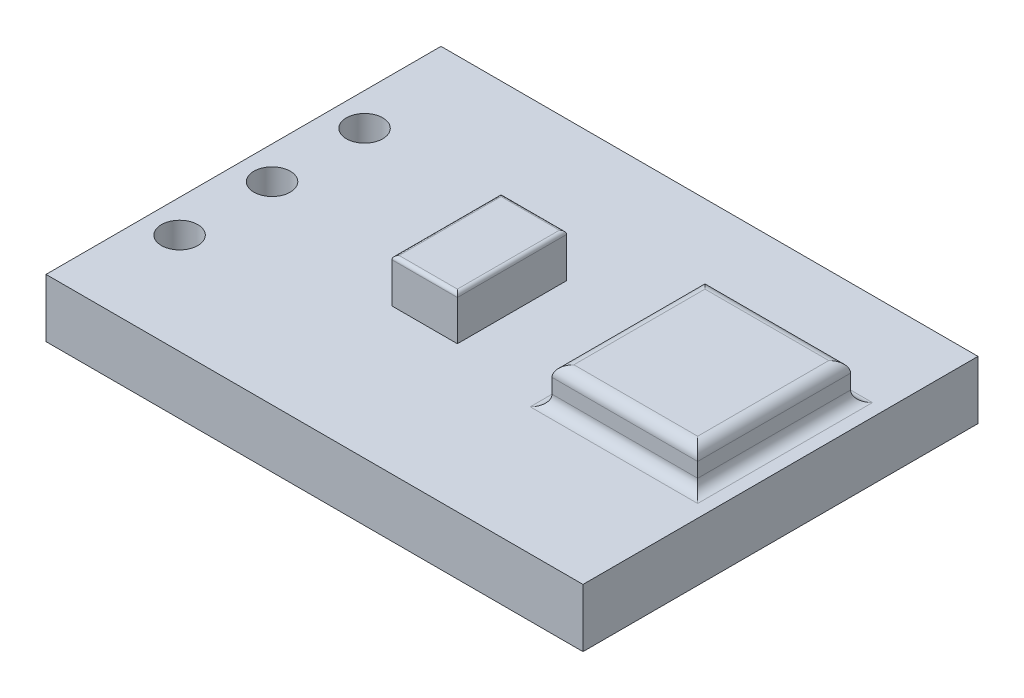
ISO-10303-21;
HEADER;
FILE_DESCRIPTION(('STEP AP214'),'2;1');
FILE_NAME('part.step','',(''),(''),'','','');
FILE_SCHEMA(('AUTOMOTIVE_DESIGN { 1 0 10303 214 1 1 1 1 }'));
ENDSEC;
DATA;
#1=APPLICATION_CONTEXT('core data for automotive mechanical design processes');
#2=APPLICATION_PROTOCOL_DEFINITION('international standard','automotive_design',2000,#1);
#3=PRODUCT_CONTEXT('',#1,'mechanical');
#4=PRODUCT('Part','Part','',(#3));
#5=PRODUCT_RELATED_PRODUCT_CATEGORY('part','',(#4));
#6=PRODUCT_DEFINITION_FORMATION('','',#4);
#7=PRODUCT_DEFINITION_CONTEXT('part definition',#1,'design');
#8=PRODUCT_DEFINITION('design','',#6,#7);
#9=PRODUCT_DEFINITION_SHAPE('','',#8);
#10=(LENGTH_UNIT() NAMED_UNIT(*) SI_UNIT(.MILLI.,.METRE.));
#11=(NAMED_UNIT(*) PLANE_ANGLE_UNIT() SI_UNIT($,.RADIAN.));
#12=(NAMED_UNIT(*) SI_UNIT($,.STERADIAN.) SOLID_ANGLE_UNIT());
#13=UNCERTAINTY_MEASURE_WITH_UNIT(LENGTH_MEASURE(1.E-05),#10,'distance_accuracy_value','');
#14=(GEOMETRIC_REPRESENTATION_CONTEXT(3) GLOBAL_UNCERTAINTY_ASSIGNED_CONTEXT((#13)) GLOBAL_UNIT_ASSIGNED_CONTEXT((#10,
#11,#12)) REPRESENTATION_CONTEXT('',''));
#15=CARTESIAN_POINT('',(0.,0.,0.));
#16=DIRECTION('',(0.,0.,1.));
#17=DIRECTION('',(1.,0.,0.));
#18=AXIS2_PLACEMENT_3D('',#15,#16,#17);
#19=CARTESIAN_POINT('',(0.,1.6,0.));
#20=DIRECTION('',(0.,-1.,0.));
#21=DIRECTION('',(0.,0.,-1.));
#22=AXIS2_PLACEMENT_3D('',#19,#20,#21);
#23=PLANE('',#22);
#24=DIRECTION('',(0.,0.,1.));
#25=VECTOR('',#24,1.);
#26=CARTESIAN_POINT('',(-344.632928539999,1.6,4.01829220130623));
#27=LINE('',#26,#25);
#28=CARTESIAN_POINT('',(-344.632928539999,1.6,8.51829220130623));
#29=VERTEX_POINT('',#28);
#30=CARTESIAN_POINT('',(-344.632928539999,1.6,3.71829220130623));
#31=VERTEX_POINT('',#30);
#32=EDGE_CURVE('E254',#29,#31,#27,.F.);
#33=ORIENTED_EDGE('',*,*,#32,.T.);
#34=DIRECTION('',(1.,0.,0.));
#35=VECTOR('',#34,1.);
#36=CARTESIAN_POINT('',(0.,1.6,3.71829220130623));
#37=LINE('',#36,#35);
#38=CARTESIAN_POINT('',(-340.032928539999,1.6,3.71829220130623));
#39=VERTEX_POINT('',#38);
#40=EDGE_CURVE('E256',#31,#39,#37,.T.);
#41=ORIENTED_EDGE('',*,*,#40,.T.);
#42=DIRECTION('',(0.,0.,1.));
#43=VECTOR('',#42,1.);
#44=CARTESIAN_POINT('',(-340.032928539999,1.6,0.));
#45=LINE('',#44,#43);
#46=CARTESIAN_POINT('',(-340.032928539999,1.6,8.51829220130623));
#47=VERTEX_POINT('',#46);
#48=EDGE_CURVE('E250',#39,#47,#45,.T.);
#49=ORIENTED_EDGE('',*,*,#48,.T.);
#50=DIRECTION('',(1.,0.,0.));
#51=VECTOR('',#50,1.);
#52=CARTESIAN_POINT('',(-344.332928539999,1.6,8.51829220130623));
#53=LINE('',#52,#51);
#54=EDGE_CURVE('E252',#47,#29,#53,.F.);
#55=ORIENTED_EDGE('',*,*,#54,.T.);
#56=EDGE_LOOP('',(#33,#41,#49,#55));
#57=FACE_BOUND('',#56,.T.);
#58=DIRECTION('',(0.,0.,1.));
#59=VECTOR('',#58,1.);
#60=CARTESIAN_POINT('',(-354.432928539998,1.6,12.0182922013062));
#61=LINE('',#60,#59);
#62=CARTESIAN_POINT('',(-354.432928539998,1.6,1.16829220130623));
#63=VERTEX_POINT('',#62);
#64=CARTESIAN_POINT('',(-354.432928539998,1.6,12.0182922013062));
#65=VERTEX_POINT('',#64);
#66=EDGE_CURVE('E221',#63,#65,#61,.T.);
#67=ORIENTED_EDGE('',*,*,#66,.T.);
#68=DIRECTION('',(1.,0.,0.));
#69=VECTOR('',#68,1.);
#70=CARTESIAN_POINT('',(-354.432928539998,1.6,12.0182922013062));
#71=LINE('',#70,#69);
#72=CARTESIAN_POINT('',(-339.682928539999,1.6,12.0182922013062));
#73=VERTEX_POINT('',#72);
#74=EDGE_CURVE('E224',#65,#73,#71,.T.);
#75=ORIENTED_EDGE('',*,*,#74,.T.);
#76=DIRECTION('',(0.,0.,-1.));
#77=VECTOR('',#76,1.);
#78=CARTESIAN_POINT('',(-339.682928539999,1.6,12.0182922013062));
#79=LINE('',#78,#77);
#80=CARTESIAN_POINT('',(-339.682928539999,1.6,1.16829220130623));
#81=VERTEX_POINT('',#80);
#82=EDGE_CURVE('E227',#73,#81,#79,.T.);
#83=ORIENTED_EDGE('',*,*,#82,.T.);
#84=DIRECTION('',(-1.,0.,0.));
#85=VECTOR('',#84,1.);
#86=CARTESIAN_POINT('',(-354.432928539998,1.6,1.16829220130623));
#87=LINE('',#86,#85);
#88=EDGE_CURVE('E229',#81,#63,#87,.T.);
#89=ORIENTED_EDGE('',*,*,#88,.T.);
#90=EDGE_LOOP('',(#67,#75,#83,#89));
#91=FACE_BOUND('',#90,.T.);
#92=CARTESIAN_POINT('',(-353.532928539999,1.6,4.16829220130623));
#93=DIRECTION('',(0.,1.,0.));
#94=DIRECTION('',(0.,0.,1.));
#95=AXIS2_PLACEMENT_3D('',#92,#93,#94);
#96=CIRCLE('',#95,0.500000000000026);
#97=CARTESIAN_POINT('',(-353.532928539999,1.6,4.66829220130626));
#98=VERTEX_POINT('',#97);
#99=EDGE_CURVE('E214',#98,#98,#96,.T.);
#100=ORIENTED_EDGE('',*,*,#99,.F.);
#101=EDGE_LOOP('',(#100));
#102=FACE_BOUND('',#101,.T.);
#103=CARTESIAN_POINT('',(-353.532928539998,1.6,9.24829220130623));
#104=DIRECTION('',(0.,1.,0.));
#105=DIRECTION('',(0.,0.,1.));
#106=AXIS2_PLACEMENT_3D('',#103,#104,#105);
#107=CIRCLE('',#106,0.500000000000026);
#108=CARTESIAN_POINT('',(-353.532928539998,1.6,9.74829220130626));
#109=VERTEX_POINT('',#108);
#110=EDGE_CURVE('E211',#109,#109,#107,.T.);
#111=ORIENTED_EDGE('',*,*,#110,.F.);
#112=EDGE_LOOP('',(#111));
#113=FACE_BOUND('',#112,.T.);
#114=CARTESIAN_POINT('',(-353.532928539999,1.6,6.70829220130623));
#115=DIRECTION('',(0.,1.,0.));
#116=DIRECTION('',(0.,0.,1.));
#117=AXIS2_PLACEMENT_3D('',#114,#115,#116);
#118=CIRCLE('',#117,0.500000000000026);
#119=CARTESIAN_POINT('',(-353.532928539999,1.6,7.20829220130626));
#120=VERTEX_POINT('',#119);
#121=EDGE_CURVE('E205',#120,#120,#118,.T.);
#122=ORIENTED_EDGE('',*,*,#121,.F.);
#123=EDGE_LOOP('',(#122));
#124=FACE_BOUND('',#123,.T.);
#125=DIRECTION('',(0.,0.,1.));
#126=VECTOR('',#125,1.);
#127=CARTESIAN_POINT('',(-348.932928539998,1.6,8.01829220130623));
#128=LINE('',#127,#126);
#129=CARTESIAN_POINT('',(-348.932928539998,1.6,5.01829220130623));
#130=VERTEX_POINT('',#129);
#131=CARTESIAN_POINT('',(-348.932928539998,1.6,8.01829220130623));
#132=VERTEX_POINT('',#131);
#133=EDGE_CURVE('E161',#130,#132,#128,.T.);
#134=ORIENTED_EDGE('',*,*,#133,.F.);
#135=DIRECTION('',(-1.,0.,0.));
#136=VECTOR('',#135,1.);
#137=CARTESIAN_POINT('',(-348.932928539998,1.6,5.01829220130623));
#138=LINE('',#137,#136);
#139=CARTESIAN_POINT('',(-347.132928539998,1.6,5.01829220130623));
#140=VERTEX_POINT('',#139);
#141=EDGE_CURVE('E168',#140,#130,#138,.T.);
#142=ORIENTED_EDGE('',*,*,#141,.F.);
#143=DIRECTION('',(0.,0.,-1.));
#144=VECTOR('',#143,1.);
#145=CARTESIAN_POINT('',(-347.132928539998,1.6,8.01829220130623));
#146=LINE('',#145,#144);
#147=CARTESIAN_POINT('',(-347.132928539998,1.6,8.01829220130623));
#148=VERTEX_POINT('',#147);
#149=EDGE_CURVE('E180',#148,#140,#146,.T.);
#150=ORIENTED_EDGE('',*,*,#149,.F.);
#151=DIRECTION('',(1.,0.,0.));
#152=VECTOR('',#151,1.);
#153=CARTESIAN_POINT('',(-348.932928539998,1.6,8.01829220130623));
#154=LINE('',#153,#152);
#155=EDGE_CURVE('E176',#132,#148,#154,.T.);
#156=ORIENTED_EDGE('',*,*,#155,.F.);
#157=EDGE_LOOP('',(#134,#142,#150,#156));
#158=FACE_BOUND('',#157,.T.);
#159=ADVANCED_FACE('F32',(#57,#91,#102,#113,#124,#158),#23,.F.);
#160=CARTESIAN_POINT('',(-354.432928539998,1.6,12.0182922013062));
#161=DIRECTION('',(1.,0.,0.));
#162=DIRECTION('',(0.,0.,-1.));
#163=AXIS2_PLACEMENT_3D('',#160,#161,#162);
#164=PLANE('',#163);
#165=DIRECTION('',(0.,0.,1.));
#166=VECTOR('',#165,1.);
#167=CARTESIAN_POINT('',(-354.432928539998,0.,12.0182922013062));
#168=LINE('',#167,#166);
#169=CARTESIAN_POINT('',(-354.432928539998,0.,1.16829220130623));
#170=VERTEX_POINT('',#169);
#171=CARTESIAN_POINT('',(-354.432928539998,0.,12.0182922013062));
#172=VERTEX_POINT('',#171);
#173=EDGE_CURVE('E220',#170,#172,#168,.T.);
#174=ORIENTED_EDGE('',*,*,#173,.T.);
#175=DIRECTION('',(0.,-1.,0.));
#176=VECTOR('',#175,1.);
#177=CARTESIAN_POINT('',(-354.432928539998,1.6,12.0182922013062));
#178=LINE('',#177,#176);
#179=EDGE_CURVE('E247',#65,#172,#178,.T.);
#180=ORIENTED_EDGE('',*,*,#179,.F.);
#181=ORIENTED_EDGE('',*,*,#66,.F.);
#182=DIRECTION('',(0.,-1.,0.));
#183=VECTOR('',#182,1.);
#184=CARTESIAN_POINT('',(-354.432928539998,1.6,1.16829220130623));
#185=LINE('',#184,#183);
#186=EDGE_CURVE('E231',#63,#170,#185,.T.);
#187=ORIENTED_EDGE('',*,*,#186,.T.);
#188=EDGE_LOOP('',(#174,#180,#181,#187));
#189=FACE_BOUND('',#188,.T.);
#190=ADVANCED_FACE('F351',(#189),#164,.F.);
#191=CARTESIAN_POINT('',(-354.432928539998,1.6,12.0182922013062));
#192=DIRECTION('',(0.,0.,-1.));
#193=DIRECTION('',(-1.,0.,0.));
#194=AXIS2_PLACEMENT_3D('',#191,#192,#193);
#195=PLANE('',#194);
#196=DIRECTION('',(1.,0.,0.));
#197=VECTOR('',#196,1.);
#198=CARTESIAN_POINT('',(-354.432928539998,0.,12.0182922013062));
#199=LINE('',#198,#197);
#200=CARTESIAN_POINT('',(-339.682928539999,0.,12.0182922013062));
#201=VERTEX_POINT('',#200);
#202=EDGE_CURVE('E234',#172,#201,#199,.T.);
#203=ORIENTED_EDGE('',*,*,#202,.T.);
#204=DIRECTION('',(0.,-1.,0.));
#205=VECTOR('',#204,1.);
#206=CARTESIAN_POINT('',(-339.682928539999,1.6,12.0182922013062));
#207=LINE('',#206,#205);
#208=EDGE_CURVE('E244',#73,#201,#207,.T.);
#209=ORIENTED_EDGE('',*,*,#208,.F.);
#210=ORIENTED_EDGE('',*,*,#74,.F.);
#211=ORIENTED_EDGE('',*,*,#179,.T.);
#212=EDGE_LOOP('',(#203,#209,#210,#211));
#213=FACE_BOUND('',#212,.T.);
#214=ADVANCED_FACE('F357',(#213),#195,.F.);
#215=CARTESIAN_POINT('',(-339.682928539999,1.6,12.0182922013062));
#216=DIRECTION('',(-1.,0.,0.));
#217=DIRECTION('',(0.,0.,1.));
#218=AXIS2_PLACEMENT_3D('',#215,#216,#217);
#219=PLANE('',#218);
#220=DIRECTION('',(0.,0.,-1.));
#221=VECTOR('',#220,1.);
#222=CARTESIAN_POINT('',(-339.682928539999,0.,12.0182922013062));
#223=LINE('',#222,#221);
#224=CARTESIAN_POINT('',(-339.682928539999,0.,1.16829220130623));
#225=VERTEX_POINT('',#224);
#226=EDGE_CURVE('E236',#201,#225,#223,.T.);
#227=ORIENTED_EDGE('',*,*,#226,.T.);
#228=DIRECTION('',(0.,-1.,0.));
#229=VECTOR('',#228,1.);
#230=CARTESIAN_POINT('',(-339.682928539999,1.6,1.16829220130623));
#231=LINE('',#230,#229);
#232=EDGE_CURVE('E241',#81,#225,#231,.T.);
#233=ORIENTED_EDGE('',*,*,#232,.F.);
#234=ORIENTED_EDGE('',*,*,#82,.F.);
#235=ORIENTED_EDGE('',*,*,#208,.T.);
#236=EDGE_LOOP('',(#227,#233,#234,#235));
#237=FACE_BOUND('',#236,.T.);
#238=ADVANCED_FACE('F372',(#237),#219,.F.);
#239=CARTESIAN_POINT('',(-354.432928539998,1.6,1.16829220130623));
#240=DIRECTION('',(0.,0.,1.));
#241=DIRECTION('',(1.,0.,0.));
#242=AXIS2_PLACEMENT_3D('',#239,#240,#241);
#243=PLANE('',#242);
#244=DIRECTION('',(-1.,0.,0.));
#245=VECTOR('',#244,1.);
#246=CARTESIAN_POINT('',(-354.432928539998,0.,1.16829220130623));
#247=LINE('',#246,#245);
#248=EDGE_CURVE('E225',#225,#170,#247,.T.);
#249=ORIENTED_EDGE('',*,*,#248,.T.);
#250=ORIENTED_EDGE('',*,*,#186,.F.);
#251=ORIENTED_EDGE('',*,*,#88,.F.);
#252=ORIENTED_EDGE('',*,*,#232,.T.);
#253=EDGE_LOOP('',(#249,#250,#251,#252));
#254=FACE_BOUND('',#253,.T.);
#255=ADVANCED_FACE('F368',(#254),#243,.F.);
#256=CARTESIAN_POINT('',(0.,0.,0.));
#257=DIRECTION('',(0.,-1.,0.));
#258=DIRECTION('',(0.,0.,-1.));
#259=AXIS2_PLACEMENT_3D('',#256,#257,#258);
#260=PLANE('',#259);
#261=CARTESIAN_POINT('',(-353.532928539999,0.,6.70829220130623));
#262=DIRECTION('',(0.,-1.,0.));
#263=DIRECTION('',(0.,0.,-1.));
#264=AXIS2_PLACEMENT_3D('',#261,#262,#263);
#265=CIRCLE('',#264,0.500000000000026);
#266=CARTESIAN_POINT('',(-353.532928539999,0.,6.2082922013062));
#267=VERTEX_POINT('',#266);
#268=EDGE_CURVE('E194',#267,#267,#265,.F.);
#269=ORIENTED_EDGE('',*,*,#268,.T.);
#270=EDGE_LOOP('',(#269));
#271=FACE_BOUND('',#270,.T.);
#272=CARTESIAN_POINT('',(-353.532928539998,0.,9.24829220130623));
#273=DIRECTION('',(0.,-1.,0.));
#274=DIRECTION('',(0.,0.,-1.));
#275=AXIS2_PLACEMENT_3D('',#272,#273,#274);
#276=CIRCLE('',#275,0.500000000000026);
#277=CARTESIAN_POINT('',(-353.532928539998,0.,8.7482922013062));
#278=VERTEX_POINT('',#277);
#279=EDGE_CURVE('E208',#278,#278,#276,.F.);
#280=ORIENTED_EDGE('',*,*,#279,.T.);
#281=EDGE_LOOP('',(#280));
#282=FACE_BOUND('',#281,.T.);
#283=CARTESIAN_POINT('',(-353.532928539999,0.,4.16829220130623));
#284=DIRECTION('',(0.,-1.,0.));
#285=DIRECTION('',(0.,0.,-1.));
#286=AXIS2_PLACEMENT_3D('',#283,#284,#285);
#287=CIRCLE('',#286,0.500000000000026);
#288=CARTESIAN_POINT('',(-353.532928539999,0.,3.6682922013062));
#289=VERTEX_POINT('',#288);
#290=EDGE_CURVE('E217',#289,#289,#287,.F.);
#291=ORIENTED_EDGE('',*,*,#290,.T.);
#292=EDGE_LOOP('',(#291));
#293=FACE_BOUND('',#292,.T.);
#294=ORIENTED_EDGE('',*,*,#173,.F.);
#295=ORIENTED_EDGE('',*,*,#248,.F.);
#296=ORIENTED_EDGE('',*,*,#226,.F.);
#297=ORIENTED_EDGE('',*,*,#202,.F.);
#298=EDGE_LOOP('',(#294,#295,#296,#297));
#299=FACE_BOUND('',#298,.T.);
#300=ADVANCED_FACE('F365',(#271,#282,#293,#299),#260,.T.);
#301=CARTESIAN_POINT('',(-353.532928539999,-1.41421356237313,4.16829220130623));
#302=DIRECTION('',(0.,1.,0.));
#303=DIRECTION('',(0.,0.,1.));
#304=AXIS2_PLACEMENT_3D('',#301,#302,#303);
#305=CYLINDRICAL_SURFACE('',#304,0.500000000000026);
#306=ORIENTED_EDGE('',*,*,#99,.T.);
#307=EDGE_LOOP('',(#306));
#308=FACE_BOUND('',#307,.T.);
#309=ORIENTED_EDGE('',*,*,#290,.F.);
#310=EDGE_LOOP('',(#309));
#311=FACE_BOUND('',#310,.T.);
#312=ADVANCED_FACE('F363',(#308,#311),#305,.F.);
#313=CARTESIAN_POINT('',(-353.532928539998,-1.41421356237313,9.24829220130623));
#314=DIRECTION('',(0.,1.,0.));
#315=DIRECTION('',(0.,0.,1.));
#316=AXIS2_PLACEMENT_3D('',#313,#314,#315);
#317=CYLINDRICAL_SURFACE('',#316,0.500000000000026);
#318=ORIENTED_EDGE('',*,*,#110,.T.);
#319=EDGE_LOOP('',(#318));
#320=FACE_BOUND('',#319,.T.);
#321=ORIENTED_EDGE('',*,*,#279,.F.);
#322=EDGE_LOOP('',(#321));
#323=FACE_BOUND('',#322,.T.);
#324=ADVANCED_FACE('F530',(#320,#323),#317,.F.);
#325=CARTESIAN_POINT('',(-353.532928539999,-1.41421356237313,6.70829220130623));
#326=DIRECTION('',(0.,1.,0.));
#327=DIRECTION('',(0.,0.,1.));
#328=AXIS2_PLACEMENT_3D('',#325,#326,#327);
#329=CYLINDRICAL_SURFACE('',#328,0.500000000000026);
#330=ORIENTED_EDGE('',*,*,#121,.T.);
#331=EDGE_LOOP('',(#330));
#332=FACE_BOUND('',#331,.T.);
#333=ORIENTED_EDGE('',*,*,#268,.F.);
#334=EDGE_LOOP('',(#333));
#335=FACE_BOUND('',#334,.T.);
#336=ADVANCED_FACE('F522',(#332,#335),#329,.F.);
#337=CARTESIAN_POINT('',(-344.332928539999,2.6,4.01829220130623));
#338=DIRECTION('',(0.,0.,-1.));
#339=DIRECTION('',(-1.,0.,0.));
#340=AXIS2_PLACEMENT_3D('',#337,#338,#339);
#341=PLANE('',#340);
#342=DIRECTION('',(0.,-1.,0.));
#343=VECTOR('',#342,1.);
#344=CARTESIAN_POINT('',(-340.332928539999,2.6,4.01829220130623));
#345=LINE('',#344,#343);
#346=CARTESIAN_POINT('',(-340.332928539999,2.3,4.01829220130623));
#347=VERTEX_POINT('',#346);
#348=CARTESIAN_POINT('',(-340.332928539999,1.9,4.01829220130623));
#349=VERTEX_POINT('',#348);
#350=EDGE_CURVE('E190',#347,#349,#345,.T.);
#351=ORIENTED_EDGE('',*,*,#350,.T.);
#352=DIRECTION('',(1.,0.,0.));
#353=VECTOR('',#352,1.);
#354=CARTESIAN_POINT('',(-344.332928539999,1.9,4.01829220130623));
#355=LINE('',#354,#353);
#356=CARTESIAN_POINT('',(-344.332928539999,1.9,4.01829220130623));
#357=VERTEX_POINT('',#356);
#358=EDGE_CURVE('E262',#349,#357,#355,.F.);
#359=ORIENTED_EDGE('',*,*,#358,.T.);
#360=DIRECTION('',(0.,-1.,0.));
#361=VECTOR('',#360,1.);
#362=CARTESIAN_POINT('',(-344.332928539999,2.6,4.01829220130623));
#363=LINE('',#362,#361);
#364=CARTESIAN_POINT('',(-344.332928539999,2.3,4.01829220130623));
#365=VERTEX_POINT('',#364);
#366=EDGE_CURVE('E191',#365,#357,#363,.T.);
#367=ORIENTED_EDGE('',*,*,#366,.F.);
#368=DIRECTION('',(1.,0.,0.));
#369=VECTOR('',#368,1.);
#370=CARTESIAN_POINT('',(-340.332928539999,2.3,4.01829220130623));
#371=LINE('',#370,#369);
#372=EDGE_CURVE('E259',#365,#347,#371,.T.);
#373=ORIENTED_EDGE('',*,*,#372,.T.);
#374=EDGE_LOOP('',(#351,#359,#367,#373));
#375=FACE_BOUND('',#374,.T.);
#376=ADVANCED_FACE('F514',(#375),#341,.T.);
#377=CARTESIAN_POINT('',(-344.332928539999,2.6,4.01829220130623));
#378=DIRECTION('',(1.,0.,0.));
#379=DIRECTION('',(0.,0.,-1.));
#380=AXIS2_PLACEMENT_3D('',#377,#378,#379);
#381=PLANE('',#380);
#382=ORIENTED_EDGE('',*,*,#366,.T.);
#383=DIRECTION('',(0.,0.,1.));
#384=VECTOR('',#383,1.);
#385=CARTESIAN_POINT('',(-344.332928539999,1.9,8.21829220130623));
#386=LINE('',#385,#384);
#387=CARTESIAN_POINT('',(-344.332928539999,1.9,8.21829220130623));
#388=VERTEX_POINT('',#387);
#389=EDGE_CURVE('E267',#357,#388,#386,.T.);
#390=ORIENTED_EDGE('',*,*,#389,.T.);
#391=DIRECTION('',(0.,-1.,0.));
#392=VECTOR('',#391,1.);
#393=CARTESIAN_POINT('',(-344.332928539999,2.6,8.21829220130623));
#394=LINE('',#393,#392);
#395=CARTESIAN_POINT('',(-344.332928539999,2.3,8.21829220130623));
#396=VERTEX_POINT('',#395);
#397=EDGE_CURVE('E195',#396,#388,#394,.T.);
#398=ORIENTED_EDGE('',*,*,#397,.F.);
#399=DIRECTION('',(0.,0.,1.));
#400=VECTOR('',#399,1.);
#401=CARTESIAN_POINT('',(-344.332928539999,2.3,4.01829220130623));
#402=LINE('',#401,#400);
#403=EDGE_CURVE('E265',#396,#365,#402,.F.);
#404=ORIENTED_EDGE('',*,*,#403,.T.);
#405=EDGE_LOOP('',(#382,#390,#398,#404));
#406=FACE_BOUND('',#405,.T.);
#407=ADVANCED_FACE('F506',(#406),#381,.F.);
#408=CARTESIAN_POINT('',(-344.332928539999,2.6,8.21829220130623));
#409=DIRECTION('',(0.,0.,-1.));
#410=DIRECTION('',(-1.,0.,0.));
#411=AXIS2_PLACEMENT_3D('',#408,#409,#410);
#412=PLANE('',#411);
#413=ORIENTED_EDGE('',*,*,#397,.T.);
#414=DIRECTION('',(1.,0.,0.));
#415=VECTOR('',#414,1.);
#416=CARTESIAN_POINT('',(-340.332928539999,1.9,8.21829220130623));
#417=LINE('',#416,#415);
#418=CARTESIAN_POINT('',(-340.332928539999,1.9,8.21829220130623));
#419=VERTEX_POINT('',#418);
#420=EDGE_CURVE('E271',#388,#419,#417,.T.);
#421=ORIENTED_EDGE('',*,*,#420,.T.);
#422=DIRECTION('',(0.,-1.,0.));
#423=VECTOR('',#422,1.);
#424=CARTESIAN_POINT('',(-340.332928539999,2.6,8.21829220130623));
#425=LINE('',#424,#423);
#426=CARTESIAN_POINT('',(-340.332928539999,2.3,8.21829220130623));
#427=VERTEX_POINT('',#426);
#428=EDGE_CURVE('E198',#427,#419,#425,.T.);
#429=ORIENTED_EDGE('',*,*,#428,.F.);
#430=DIRECTION('',(1.,0.,0.));
#431=VECTOR('',#430,1.);
#432=CARTESIAN_POINT('',(-344.332928539999,2.3,8.21829220130623));
#433=LINE('',#432,#431);
#434=EDGE_CURVE('E269',#427,#396,#433,.F.);
#435=ORIENTED_EDGE('',*,*,#434,.T.);
#436=EDGE_LOOP('',(#413,#421,#429,#435));
#437=FACE_BOUND('',#436,.T.);
#438=ADVANCED_FACE('F498',(#437),#412,.F.);
#439=CARTESIAN_POINT('',(-340.332928539999,2.6,4.01829220130623));
#440=DIRECTION('',(1.,0.,0.));
#441=DIRECTION('',(0.,0.,-1.));
#442=AXIS2_PLACEMENT_3D('',#439,#440,#441);
#443=PLANE('',#442);
#444=ORIENTED_EDGE('',*,*,#428,.T.);
#445=DIRECTION('',(0.,0.,1.));
#446=VECTOR('',#445,1.);
#447=CARTESIAN_POINT('',(-340.332928539999,1.9,4.01829220130623));
#448=LINE('',#447,#446);
#449=EDGE_CURVE('E275',#419,#349,#448,.F.);
#450=ORIENTED_EDGE('',*,*,#449,.T.);
#451=ORIENTED_EDGE('',*,*,#350,.F.);
#452=DIRECTION('',(0.,0.,1.));
#453=VECTOR('',#452,1.);
#454=CARTESIAN_POINT('',(-340.332928539999,2.3,8.21829220130623));
#455=LINE('',#454,#453);
#456=EDGE_CURVE('E273',#347,#427,#455,.T.);
#457=ORIENTED_EDGE('',*,*,#456,.T.);
#458=EDGE_LOOP('',(#444,#450,#451,#457));
#459=FACE_BOUND('',#458,.T.);
#460=ADVANCED_FACE('F490',(#459),#443,.T.);
#461=CARTESIAN_POINT('',(0.,2.6,0.));
#462=DIRECTION('',(0.,-1.,0.));
#463=DIRECTION('',(0.,0.,-1.));
#464=AXIS2_PLACEMENT_3D('',#461,#462,#463);
#465=PLANE('',#464);
#466=DIRECTION('',(0.,0.,1.));
#467=VECTOR('',#466,1.);
#468=CARTESIAN_POINT('',(-340.632928539999,2.6,4.01829220130623));
#469=LINE('',#468,#467);
#470=CARTESIAN_POINT('',(-340.632928539999,2.6,7.91829220130623));
#471=VERTEX_POINT('',#470);
#472=CARTESIAN_POINT('',(-340.632928539999,2.6,4.31829220130623));
#473=VERTEX_POINT('',#472);
#474=EDGE_CURVE('E281',#471,#473,#469,.F.);
#475=ORIENTED_EDGE('',*,*,#474,.T.);
#476=DIRECTION('',(1.,0.,0.));
#477=VECTOR('',#476,1.);
#478=CARTESIAN_POINT('',(-344.332928539999,2.6,4.31829220130623));
#479=LINE('',#478,#477);
#480=CARTESIAN_POINT('',(-344.032928539999,2.6,4.31829220130623));
#481=VERTEX_POINT('',#480);
#482=EDGE_CURVE('E283',#473,#481,#479,.F.);
#483=ORIENTED_EDGE('',*,*,#482,.T.);
#484=DIRECTION('',(0.,0.,1.));
#485=VECTOR('',#484,1.);
#486=CARTESIAN_POINT('',(-344.032928539999,2.6,0.));
#487=LINE('',#486,#485);
#488=CARTESIAN_POINT('',(-344.032928539999,2.6,7.91829220130623));
#489=VERTEX_POINT('',#488);
#490=EDGE_CURVE('E277',#481,#489,#487,.T.);
#491=ORIENTED_EDGE('',*,*,#490,.T.);
#492=DIRECTION('',(1.,0.,0.));
#493=VECTOR('',#492,1.);
#494=CARTESIAN_POINT('',(0.,2.6,7.91829220130623));
#495=LINE('',#494,#493);
#496=EDGE_CURVE('E279',#489,#471,#495,.T.);
#497=ORIENTED_EDGE('',*,*,#496,.T.);
#498=EDGE_LOOP('',(#475,#483,#491,#497));
#499=FACE_BOUND('',#498,.T.);
#500=ADVANCED_FACE('F348',(#499),#465,.F.);
#501=CARTESIAN_POINT('',(-348.932928539998,2.8,8.01829220130623));
#502=DIRECTION('',(1.,0.,0.));
#503=DIRECTION('',(0.,0.,-1.));
#504=AXIS2_PLACEMENT_3D('',#501,#502,#503);
#505=PLANE('',#504);
#506=DIRECTION('',(0.,-1.,0.));
#507=VECTOR('',#506,1.);
#508=CARTESIAN_POINT('',(-348.932928539998,2.8,8.01829220130623));
#509=LINE('',#508,#507);
#510=CARTESIAN_POINT('',(-348.932928539998,2.7,8.01829220130623));
#511=VERTEX_POINT('',#510);
#512=EDGE_CURVE('E188',#511,#132,#509,.T.);
#513=ORIENTED_EDGE('',*,*,#512,.F.);
#514=DIRECTION('',(0.,0.,1.));
#515=VECTOR('',#514,1.);
#516=CARTESIAN_POINT('',(-348.932928539998,2.7,8.01829220130623));
#517=LINE('',#516,#515);
#518=CARTESIAN_POINT('',(-348.932928539998,2.7,5.01829220130623));
#519=VERTEX_POINT('',#518);
#520=EDGE_CURVE('E11',#511,#519,#517,.F.);
#521=ORIENTED_EDGE('',*,*,#520,.T.);
#522=DIRECTION('',(0.,-1.,0.));
#523=VECTOR('',#522,1.);
#524=CARTESIAN_POINT('',(-348.932928539998,2.8,5.01829220130623));
#525=LINE('',#524,#523);
#526=EDGE_CURVE('E158',#519,#130,#525,.T.);
#527=ORIENTED_EDGE('',*,*,#526,.T.);
#528=ORIENTED_EDGE('',*,*,#133,.T.);
#529=EDGE_LOOP('',(#513,#521,#527,#528));
#530=FACE_BOUND('',#529,.T.);
#531=ADVANCED_FACE('F160',(#530),#505,.F.);
#532=CARTESIAN_POINT('',(-348.932928539998,2.8,8.01829220130623));
#533=DIRECTION('',(0.,0.,-1.));
#534=DIRECTION('',(-1.,0.,0.));
#535=AXIS2_PLACEMENT_3D('',#532,#533,#534);
#536=PLANE('',#535);
#537=DIRECTION('',(0.,-1.,0.));
#538=VECTOR('',#537,1.);
#539=CARTESIAN_POINT('',(-347.132928539998,2.8,8.01829220130623));
#540=LINE('',#539,#538);
#541=CARTESIAN_POINT('',(-347.132928539998,2.7,8.01829220130623));
#542=VERTEX_POINT('',#541);
#543=EDGE_CURVE('E186',#542,#148,#540,.T.);
#544=ORIENTED_EDGE('',*,*,#543,.F.);
#545=DIRECTION('',(1.,0.,0.));
#546=VECTOR('',#545,1.);
#547=CARTESIAN_POINT('',(-348.932928539998,2.7,8.01829220130623));
#548=LINE('',#547,#546);
#549=EDGE_CURVE('E41',#542,#511,#548,.F.);
#550=ORIENTED_EDGE('',*,*,#549,.T.);
#551=ORIENTED_EDGE('',*,*,#512,.T.);
#552=ORIENTED_EDGE('',*,*,#155,.T.);
#553=EDGE_LOOP('',(#544,#550,#551,#552));
#554=FACE_BOUND('',#553,.T.);
#555=ADVANCED_FACE('F340',(#554),#536,.F.);
#556=CARTESIAN_POINT('',(-347.132928539998,2.8,8.01829220130623));
#557=DIRECTION('',(-1.,0.,0.));
#558=DIRECTION('',(0.,0.,1.));
#559=AXIS2_PLACEMENT_3D('',#556,#557,#558);
#560=PLANE('',#559);
#561=DIRECTION('',(0.,-1.,0.));
#562=VECTOR('',#561,1.);
#563=CARTESIAN_POINT('',(-347.132928539998,2.8,5.01829220130623));
#564=LINE('',#563,#562);
#565=CARTESIAN_POINT('',(-347.132928539998,2.7,5.01829220130623));
#566=VERTEX_POINT('',#565);
#567=EDGE_CURVE('E167',#566,#140,#564,.T.);
#568=ORIENTED_EDGE('',*,*,#567,.F.);
#569=DIRECTION('',(0.,0.,-1.));
#570=VECTOR('',#569,1.);
#571=CARTESIAN_POINT('',(-347.132928539998,2.7,8.01829220130623));
#572=LINE('',#571,#570);
#573=EDGE_CURVE('E56',#566,#542,#572,.F.);
#574=ORIENTED_EDGE('',*,*,#573,.T.);
#575=ORIENTED_EDGE('',*,*,#543,.T.);
#576=ORIENTED_EDGE('',*,*,#149,.T.);
#577=EDGE_LOOP('',(#568,#574,#575,#576));
#578=FACE_BOUND('',#577,.T.);
#579=ADVANCED_FACE('F339',(#578),#560,.F.);
#580=CARTESIAN_POINT('',(-348.932928539998,2.8,5.01829220130623));
#581=DIRECTION('',(0.,0.,1.));
#582=DIRECTION('',(1.,0.,0.));
#583=AXIS2_PLACEMENT_3D('',#580,#581,#582);
#584=PLANE('',#583);
#585=ORIENTED_EDGE('',*,*,#526,.F.);
#586=DIRECTION('',(-1.,0.,0.));
#587=VECTOR('',#586,1.);
#588=CARTESIAN_POINT('',(-348.932928539998,2.7,5.01829220130623));
#589=LINE('',#588,#587);
#590=EDGE_CURVE('E314',#519,#566,#589,.F.);
#591=ORIENTED_EDGE('',*,*,#590,.T.);
#592=ORIENTED_EDGE('',*,*,#567,.T.);
#593=ORIENTED_EDGE('',*,*,#141,.T.);
#594=EDGE_LOOP('',(#585,#591,#592,#593));
#595=FACE_BOUND('',#594,.T.);
#596=ADVANCED_FACE('F179',(#595),#584,.F.);
#597=CARTESIAN_POINT('',(0.,2.8,0.));
#598=DIRECTION('',(0.,-1.,0.));
#599=DIRECTION('',(0.,0.,-1.));
#600=AXIS2_PLACEMENT_3D('',#597,#598,#599);
#601=PLANE('',#600);
#602=DIRECTION('',(0.,0.,-1.));
#603=VECTOR('',#602,1.);
#604=CARTESIAN_POINT('',(-347.232928539999,2.8,0.));
#605=LINE('',#604,#603);
#606=CARTESIAN_POINT('',(-347.232928539999,2.8,7.91829220130623));
#607=VERTEX_POINT('',#606);
#608=CARTESIAN_POINT('',(-347.232928539999,2.8,5.11829220130623));
#609=VERTEX_POINT('',#608);
#610=EDGE_CURVE('E309',#607,#609,#605,.T.);
#611=ORIENTED_EDGE('',*,*,#610,.T.);
#612=DIRECTION('',(-1.,0.,0.));
#613=VECTOR('',#612,1.);
#614=CARTESIAN_POINT('',(0.,2.8,5.11829220130589));
#615=LINE('',#614,#613);
#616=CARTESIAN_POINT('',(-348.832928539999,2.8,5.11829220130623));
#617=VERTEX_POINT('',#616);
#618=EDGE_CURVE('E311',#609,#617,#615,.T.);
#619=ORIENTED_EDGE('',*,*,#618,.T.);
#620=DIRECTION('',(0.,0.,1.));
#621=VECTOR('',#620,1.);
#622=CARTESIAN_POINT('',(-348.832928539999,2.8,0.));
#623=LINE('',#622,#621);
#624=CARTESIAN_POINT('',(-348.832928539999,2.8,7.91829220130623));
#625=VERTEX_POINT('',#624);
#626=EDGE_CURVE('E286',#617,#625,#623,.T.);
#627=ORIENTED_EDGE('',*,*,#626,.T.);
#628=DIRECTION('',(1.,0.,0.));
#629=VECTOR('',#628,1.);
#630=CARTESIAN_POINT('',(0.,2.8,7.91829220130623));
#631=LINE('',#630,#629);
#632=EDGE_CURVE('E307',#625,#607,#631,.T.);
#633=ORIENTED_EDGE('',*,*,#632,.T.);
#634=EDGE_LOOP('',(#611,#619,#627,#633));
#635=FACE_BOUND('',#634,.T.);
#636=ADVANCED_FACE('F396',(#635),#601,.F.);
#637=CARTESIAN_POINT('',(-344.332928539999,1.9,8.51829220130623));
#638=DIRECTION('',(-1.,0.,0.));
#639=DIRECTION('',(0.,0.,1.));
#640=AXIS2_PLACEMENT_3D('',#637,#638,#639);
#641=CYLINDRICAL_SURFACE('',#640,0.3);
#642=CARTESIAN_POINT('',(-340.032928539999,1.9,8.51829220130623));
#643=DIRECTION('',(-0.707106781186547,0.,0.707106781186547));
#644=DIRECTION('',(0.707106781186547,0.,0.707106781186547));
#645=AXIS2_PLACEMENT_3D('',#642,#643,#644);
#646=ELLIPSE('',#645,0.424264068711928,0.3);
#647=EDGE_CURVE('E292',#419,#47,#646,.T.);
#648=ORIENTED_EDGE('',*,*,#647,.F.);
#649=ORIENTED_EDGE('',*,*,#420,.F.);
#650=CARTESIAN_POINT('',(-344.632928539999,1.9,8.51829220130623));
#651=DIRECTION('',(-0.707106781186547,0.,-0.707106781186547));
#652=DIRECTION('',(-0.707106781186547,0.,0.707106781186547));
#653=AXIS2_PLACEMENT_3D('',#650,#651,#652);
#654=ELLIPSE('',#653,0.424264068711928,0.3);
#655=EDGE_CURVE('E177',#29,#388,#654,.F.);
#656=ORIENTED_EDGE('',*,*,#655,.F.);
#657=ORIENTED_EDGE('',*,*,#54,.F.);
#658=EDGE_LOOP('',(#648,#649,#656,#657));
#659=FACE_BOUND('',#658,.T.);
#660=ADVANCED_FACE('F392',(#659),#641,.F.);
#661=CARTESIAN_POINT('',(-344.632928539999,1.9,4.01829220130623));
#662=DIRECTION('',(0.,0.,-1.));
#663=DIRECTION('',(-1.,0.,0.));
#664=AXIS2_PLACEMENT_3D('',#661,#662,#663);
#665=CYLINDRICAL_SURFACE('',#664,0.3);
#666=ORIENTED_EDGE('',*,*,#655,.T.);
#667=ORIENTED_EDGE('',*,*,#389,.F.);
#668=CARTESIAN_POINT('',(-344.632928539999,1.9,3.71829220130623));
#669=DIRECTION('',(0.707106781186547,0.,-0.707106781186547));
#670=DIRECTION('',(-0.707106781186547,0.,-0.707106781186547));
#671=AXIS2_PLACEMENT_3D('',#668,#669,#670);
#672=ELLIPSE('',#671,0.424264068711928,0.3);
#673=EDGE_CURVE('E289',#31,#357,#672,.F.);
#674=ORIENTED_EDGE('',*,*,#673,.F.);
#675=ORIENTED_EDGE('',*,*,#32,.F.);
#676=EDGE_LOOP('',(#666,#667,#674,#675));
#677=FACE_BOUND('',#676,.T.);
#678=ADVANCED_FACE('F388',(#677),#665,.F.);
#679=CARTESIAN_POINT('',(-340.032928539999,1.9,0.));
#680=DIRECTION('',(0.,0.,1.));
#681=DIRECTION('',(1.,0.,0.));
#682=AXIS2_PLACEMENT_3D('',#679,#680,#681);
#683=CYLINDRICAL_SURFACE('',#682,0.3);
#684=ORIENTED_EDGE('',*,*,#647,.T.);
#685=ORIENTED_EDGE('',*,*,#48,.F.);
#686=CARTESIAN_POINT('',(-340.032928539999,1.9,3.71829220130623));
#687=DIRECTION('',(0.707106781186547,0.,0.707106781186547));
#688=DIRECTION('',(-0.707106781186547,0.,0.707106781186547));
#689=AXIS2_PLACEMENT_3D('',#686,#687,#688);
#690=ELLIPSE('',#689,0.424264068711928,0.3);
#691=EDGE_CURVE('E287',#349,#39,#690,.T.);
#692=ORIENTED_EDGE('',*,*,#691,.F.);
#693=ORIENTED_EDGE('',*,*,#449,.F.);
#694=EDGE_LOOP('',(#684,#685,#692,#693));
#695=FACE_BOUND('',#694,.T.);
#696=ADVANCED_FACE('F384',(#695),#683,.F.);
#697=CARTESIAN_POINT('',(0.,1.9,3.71829220130623));
#698=DIRECTION('',(1.,0.,0.));
#699=DIRECTION('',(0.,0.,-1.));
#700=AXIS2_PLACEMENT_3D('',#697,#698,#699);
#701=CYLINDRICAL_SURFACE('',#700,0.3);
#702=ORIENTED_EDGE('',*,*,#673,.T.);
#703=ORIENTED_EDGE('',*,*,#358,.F.);
#704=ORIENTED_EDGE('',*,*,#691,.T.);
#705=ORIENTED_EDGE('',*,*,#40,.F.);
#706=EDGE_LOOP('',(#702,#703,#704,#705));
#707=FACE_BOUND('',#706,.T.);
#708=ADVANCED_FACE('F380',(#707),#701,.F.);
#709=CARTESIAN_POINT('',(0.,2.3,7.91829220130623));
#710=DIRECTION('',(1.,0.,0.));
#711=DIRECTION('',(0.,0.,-1.));
#712=AXIS2_PLACEMENT_3D('',#709,#710,#711);
#713=CYLINDRICAL_SURFACE('',#712,0.3);
#714=CARTESIAN_POINT('',(-340.632928539999,2.3,7.91829220130623));
#715=DIRECTION('',(0.707106781186547,0.,-0.707106781186547));
#716=DIRECTION('',(0.707106781186547,0.,0.707106781186547));
#717=AXIS2_PLACEMENT_3D('',#714,#715,#716);
#718=ELLIPSE('',#717,0.424264068711928,0.3);
#719=EDGE_CURVE('E301',#471,#427,#718,.T.);
#720=ORIENTED_EDGE('',*,*,#719,.F.);
#721=ORIENTED_EDGE('',*,*,#496,.F.);
#722=CARTESIAN_POINT('',(-344.032928539999,2.3,7.91829220130623));
#723=DIRECTION('',(0.707106781186547,0.,0.707106781186547));
#724=DIRECTION('',(-0.707106781186547,0.,0.707106781186547));
#725=AXIS2_PLACEMENT_3D('',#722,#723,#724);
#726=ELLIPSE('',#725,0.424264068711928,0.3);
#727=EDGE_CURVE('E290',#396,#489,#726,.F.);
#728=ORIENTED_EDGE('',*,*,#727,.F.);
#729=ORIENTED_EDGE('',*,*,#434,.F.);
#730=EDGE_LOOP('',(#720,#721,#728,#729));
#731=FACE_BOUND('',#730,.T.);
#732=ADVANCED_FACE('F383',(#731),#713,.T.);
#733=CARTESIAN_POINT('',(-344.032928539999,2.3,0.));
#734=DIRECTION('',(0.,0.,1.));
#735=DIRECTION('',(1.,0.,0.));
#736=AXIS2_PLACEMENT_3D('',#733,#734,#735);
#737=CYLINDRICAL_SURFACE('',#736,0.3);
#738=ORIENTED_EDGE('',*,*,#727,.T.);
#739=ORIENTED_EDGE('',*,*,#490,.F.);
#740=CARTESIAN_POINT('',(-344.032928539999,2.3,4.31829220130623));
#741=DIRECTION('',(-0.707106781186547,0.,0.707106781186547));
#742=DIRECTION('',(0.707106781186547,0.,0.707106781186547));
#743=AXIS2_PLACEMENT_3D('',#740,#741,#742);
#744=ELLIPSE('',#743,0.424264068711928,0.3);
#745=EDGE_CURVE('E299',#365,#481,#744,.F.);
#746=ORIENTED_EDGE('',*,*,#745,.F.);
#747=ORIENTED_EDGE('',*,*,#403,.F.);
#748=EDGE_LOOP('',(#738,#739,#746,#747));
#749=FACE_BOUND('',#748,.T.);
#750=ADVANCED_FACE('F405',(#749),#737,.T.);
#751=CARTESIAN_POINT('',(-340.632928539999,2.3,4.01829220130623));
#752=DIRECTION('',(0.,0.,-1.));
#753=DIRECTION('',(-1.,0.,0.));
#754=AXIS2_PLACEMENT_3D('',#751,#752,#753);
#755=CYLINDRICAL_SURFACE('',#754,0.3);
#756=ORIENTED_EDGE('',*,*,#719,.T.);
#757=ORIENTED_EDGE('',*,*,#456,.F.);
#758=CARTESIAN_POINT('',(-340.632928539999,2.3,4.31829220130623));
#759=DIRECTION('',(-0.707106781186547,0.,-0.707106781186547));
#760=DIRECTION('',(0.707106781186547,0.,-0.707106781186547));
#761=AXIS2_PLACEMENT_3D('',#758,#759,#760);
#762=ELLIPSE('',#761,0.424264068711928,0.3);
#763=EDGE_CURVE('E297',#473,#347,#762,.T.);
#764=ORIENTED_EDGE('',*,*,#763,.F.);
#765=ORIENTED_EDGE('',*,*,#474,.F.);
#766=EDGE_LOOP('',(#756,#757,#764,#765));
#767=FACE_BOUND('',#766,.T.);
#768=ADVANCED_FACE('F401',(#767),#755,.T.);
#769=CARTESIAN_POINT('',(-344.332928539999,2.3,4.31829220130623));
#770=DIRECTION('',(-1.,0.,0.));
#771=DIRECTION('',(0.,0.,1.));
#772=AXIS2_PLACEMENT_3D('',#769,#770,#771);
#773=CYLINDRICAL_SURFACE('',#772,0.3);
#774=ORIENTED_EDGE('',*,*,#745,.T.);
#775=ORIENTED_EDGE('',*,*,#482,.F.);
#776=ORIENTED_EDGE('',*,*,#763,.T.);
#777=ORIENTED_EDGE('',*,*,#372,.F.);
#778=EDGE_LOOP('',(#774,#775,#776,#777));
#779=FACE_BOUND('',#778,.T.);
#780=ADVANCED_FACE('F398',(#779),#773,.T.);
#781=CARTESIAN_POINT('',(0.,2.7,7.91829220130623));
#782=DIRECTION('',(1.,0.,0.));
#783=DIRECTION('',(0.,0.,-1.));
#784=AXIS2_PLACEMENT_3D('',#781,#782,#783);
#785=CYLINDRICAL_SURFACE('',#784,0.1);
#786=CARTESIAN_POINT('',(-348.832928539999,2.7,7.91829220130623));
#787=DIRECTION('',(0.707106781186547,0.,0.707106781186547));
#788=DIRECTION('',(-0.707106781186547,0.,0.707106781186547));
#789=AXIS2_PLACEMENT_3D('',#786,#787,#788);
#790=ELLIPSE('',#789,0.14142135623731,0.1);
#791=EDGE_CURVE('E321',#511,#625,#790,.F.);
#792=ORIENTED_EDGE('',*,*,#791,.F.);
#793=ORIENTED_EDGE('',*,*,#549,.F.);
#794=CARTESIAN_POINT('',(-347.232928539999,2.7,7.91829220130623));
#795=DIRECTION('',(0.707106781186547,0.,-0.707106781186547));
#796=DIRECTION('',(0.707106781186547,0.,0.707106781186547));
#797=AXIS2_PLACEMENT_3D('',#794,#795,#796);
#798=ELLIPSE('',#797,0.14142135623731,0.1);
#799=EDGE_CURVE('E36',#607,#542,#798,.T.);
#800=ORIENTED_EDGE('',*,*,#799,.F.);
#801=ORIENTED_EDGE('',*,*,#632,.F.);
#802=EDGE_LOOP('',(#792,#793,#800,#801));
#803=FACE_BOUND('',#802,.T.);
#804=ADVANCED_FACE('F34',(#803),#785,.T.);
#805=CARTESIAN_POINT('',(-347.232928539999,2.7,0.));
#806=DIRECTION('',(0.,0.,-1.));
#807=DIRECTION('',(-1.,0.,0.));
#808=AXIS2_PLACEMENT_3D('',#805,#806,#807);
#809=CYLINDRICAL_SURFACE('',#808,0.1);
#810=ORIENTED_EDGE('',*,*,#799,.T.);
#811=ORIENTED_EDGE('',*,*,#573,.F.);
#812=CARTESIAN_POINT('',(-347.232928539999,2.7,5.11829220130623));
#813=DIRECTION('',(-0.707106781186548,0.,-0.707106781186547));
#814=DIRECTION('',(0.707106781186547,0.,-0.707106781186548));
#815=AXIS2_PLACEMENT_3D('',#812,#813,#814);
#816=ELLIPSE('',#815,0.14142135623731,0.1);
#817=EDGE_CURVE('E320',#609,#566,#816,.T.);
#818=ORIENTED_EDGE('',*,*,#817,.F.);
#819=ORIENTED_EDGE('',*,*,#610,.F.);
#820=EDGE_LOOP('',(#810,#811,#818,#819));
#821=FACE_BOUND('',#820,.T.);
#822=ADVANCED_FACE('F330',(#821),#809,.T.);
#823=CARTESIAN_POINT('',(-348.832928539999,2.7,0.));
#824=DIRECTION('',(0.,0.,1.));
#825=DIRECTION('',(1.,0.,0.));
#826=AXIS2_PLACEMENT_3D('',#823,#824,#825);
#827=CYLINDRICAL_SURFACE('',#826,0.1);
#828=ORIENTED_EDGE('',*,*,#791,.T.);
#829=ORIENTED_EDGE('',*,*,#626,.F.);
#830=CARTESIAN_POINT('',(-348.832928539999,2.7,5.11829220130623));
#831=DIRECTION('',(-0.707106781186547,0.,0.707106781186548));
#832=DIRECTION('',(0.707106781186548,0.,0.707106781186547));
#833=AXIS2_PLACEMENT_3D('',#830,#831,#832);
#834=ELLIPSE('',#833,0.141421356237309,0.1);
#835=EDGE_CURVE('E318',#519,#617,#834,.F.);
#836=ORIENTED_EDGE('',*,*,#835,.F.);
#837=ORIENTED_EDGE('',*,*,#520,.F.);
#838=EDGE_LOOP('',(#828,#829,#836,#837));
#839=FACE_BOUND('',#838,.T.);
#840=ADVANCED_FACE('F335',(#839),#827,.T.);
#841=CARTESIAN_POINT('',(0.,2.7,5.11829220130589));
#842=DIRECTION('',(-1.,0.,0.));
#843=DIRECTION('',(0.,0.,1.));
#844=AXIS2_PLACEMENT_3D('',#841,#842,#843);
#845=CYLINDRICAL_SURFACE('',#844,0.1);
#846=ORIENTED_EDGE('',*,*,#817,.T.);
#847=ORIENTED_EDGE('',*,*,#590,.F.);
#848=ORIENTED_EDGE('',*,*,#835,.T.);
#849=ORIENTED_EDGE('',*,*,#618,.F.);
#850=EDGE_LOOP('',(#846,#847,#848,#849));
#851=FACE_BOUND('',#850,.T.);
#852=ADVANCED_FACE('F338',(#851),#845,.T.);
#853=CLOSED_SHELL('',(#159,#190,#214,#238,#255,#300,#312,#324,#336,#376,#407,#438,#460,#500,
#531,#555,#579,#596,#636,#660,#678,#696,#708,#732,#750,#768,#780,#804,#822,#840,#852));
#854=MANIFOLD_SOLID_BREP('B2',#853);
#855=ADVANCED_BREP_SHAPE_REPRESENTATION('',(#18,#854),#14);
#856=SHAPE_DEFINITION_REPRESENTATION(#9,#855);
ENDSEC;
END-ISO-10303-21;
